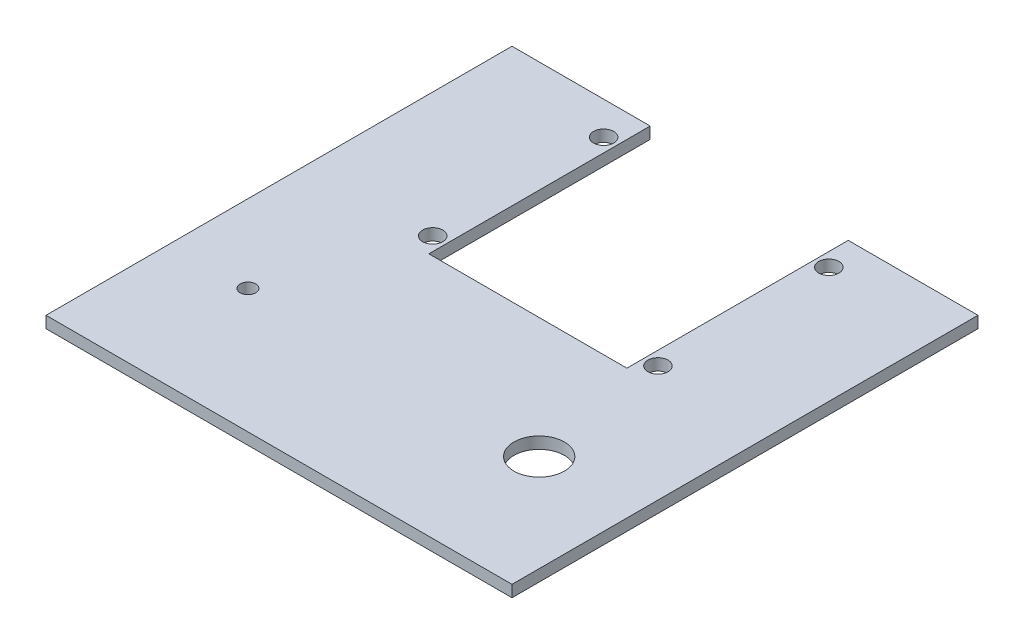
ISO-10303-21;
HEADER;
FILE_DESCRIPTION(('STEP AP214'),'2;1');
FILE_NAME('part.step','',(''),(''),'','','');
FILE_SCHEMA(('AUTOMOTIVE_DESIGN { 1 0 10303 214 1 1 1 1 }'));
ENDSEC;
DATA;
#1=APPLICATION_CONTEXT('core data for automotive mechanical design processes');
#2=APPLICATION_PROTOCOL_DEFINITION('international standard','automotive_design',2000,#1);
#3=PRODUCT_CONTEXT('',#1,'mechanical');
#4=PRODUCT('Part','Part','',(#3));
#5=PRODUCT_RELATED_PRODUCT_CATEGORY('part','',(#4));
#6=PRODUCT_DEFINITION_FORMATION('','',#4);
#7=PRODUCT_DEFINITION_CONTEXT('part definition',#1,'design');
#8=PRODUCT_DEFINITION('design','',#6,#7);
#9=PRODUCT_DEFINITION_SHAPE('','',#8);
#10=(LENGTH_UNIT() NAMED_UNIT(*) SI_UNIT(.MILLI.,.METRE.));
#11=(NAMED_UNIT(*) PLANE_ANGLE_UNIT() SI_UNIT($,.RADIAN.));
#12=(NAMED_UNIT(*) SI_UNIT($,.STERADIAN.) SOLID_ANGLE_UNIT());
#13=UNCERTAINTY_MEASURE_WITH_UNIT(LENGTH_MEASURE(1.E-05),#10,'distance_accuracy_value','');
#14=(GEOMETRIC_REPRESENTATION_CONTEXT(3) GLOBAL_UNCERTAINTY_ASSIGNED_CONTEXT((#13)) GLOBAL_UNIT_ASSIGNED_CONTEXT((#10,
#11,#12)) REPRESENTATION_CONTEXT('',''));
#15=CARTESIAN_POINT('',(0.,0.,0.));
#16=DIRECTION('',(0.,0.,1.));
#17=DIRECTION('',(1.,0.,0.));
#18=AXIS2_PLACEMENT_3D('',#15,#16,#17);
#19=CARTESIAN_POINT('',(0.,3.,0.));
#20=DIRECTION('',(0.,0.,1.));
#21=DIRECTION('',(1.,0.,0.));
#22=AXIS2_PLACEMENT_3D('',#19,#20,#21);
#23=PLANE('',#22);
#24=DIRECTION('',(-1.,0.,0.));
#25=VECTOR('',#24,1.);
#26=CARTESIAN_POINT('',(0.,3.,0.));
#27=LINE('',#26,#25);
#28=CARTESIAN_POINT('',(35.586613668419,3.,0.));
#29=VERTEX_POINT('',#28);
#30=CARTESIAN_POINT('',(0.,3.,0.));
#31=VERTEX_POINT('',#30);
#32=EDGE_CURVE('E60',#29,#31,#27,.T.);
#33=ORIENTED_EDGE('',*,*,#32,.F.);
#34=DIRECTION('',(0.,1.,0.));
#35=VECTOR('',#34,1.);
#36=CARTESIAN_POINT('',(35.586613668419,0.,0.));
#37=LINE('',#36,#35);
#38=CARTESIAN_POINT('',(35.586613668419,0.,0.));
#39=VERTEX_POINT('',#38);
#40=EDGE_CURVE('E141',#39,#29,#37,.T.);
#41=ORIENTED_EDGE('',*,*,#40,.F.);
#42=DIRECTION('',(-1.,0.,0.));
#43=VECTOR('',#42,1.);
#44=CARTESIAN_POINT('',(0.,0.,0.));
#45=LINE('',#44,#43);
#46=CARTESIAN_POINT('',(0.,0.,0.));
#47=VERTEX_POINT('',#46);
#48=EDGE_CURVE('E82',#39,#47,#45,.T.);
#49=ORIENTED_EDGE('',*,*,#48,.T.);
#50=DIRECTION('',(0.,-1.,0.));
#51=VECTOR('',#50,1.);
#52=CARTESIAN_POINT('',(0.,3.,0.));
#53=LINE('',#52,#51);
#54=EDGE_CURVE('E168',#31,#47,#53,.T.);
#55=ORIENTED_EDGE('',*,*,#54,.F.);
#56=EDGE_LOOP('',(#33,#41,#49,#55));
#57=FACE_BOUND('',#56,.T.);
#58=ADVANCED_FACE('F36',(#57),#23,.F.);
#59=CARTESIAN_POINT('',(0.,3.,120.));
#60=DIRECTION('',(1.,0.,0.));
#61=DIRECTION('',(0.,0.,-1.));
#62=AXIS2_PLACEMENT_3D('',#59,#60,#61);
#63=PLANE('',#62);
#64=DIRECTION('',(0.,0.,1.));
#65=VECTOR('',#64,1.);
#66=CARTESIAN_POINT('',(0.,0.,120.));
#67=LINE('',#66,#65);
#68=CARTESIAN_POINT('',(0.,0.,120.));
#69=VERTEX_POINT('',#68);
#70=EDGE_CURVE('E169',#47,#69,#67,.T.);
#71=ORIENTED_EDGE('',*,*,#70,.T.);
#72=DIRECTION('',(0.,-1.,0.));
#73=VECTOR('',#72,1.);
#74=CARTESIAN_POINT('',(0.,3.,120.));
#75=LINE('',#74,#73);
#76=CARTESIAN_POINT('',(0.,3.,120.));
#77=VERTEX_POINT('',#76);
#78=EDGE_CURVE('E11',#77,#69,#75,.T.);
#79=ORIENTED_EDGE('',*,*,#78,.F.);
#80=DIRECTION('',(0.,0.,1.));
#81=VECTOR('',#80,1.);
#82=CARTESIAN_POINT('',(0.,3.,120.));
#83=LINE('',#82,#81);
#84=EDGE_CURVE('E159',#31,#77,#83,.T.);
#85=ORIENTED_EDGE('',*,*,#84,.F.);
#86=ORIENTED_EDGE('',*,*,#54,.T.);
#87=EDGE_LOOP('',(#71,#79,#85,#86));
#88=FACE_BOUND('',#87,.T.);
#89=ADVANCED_FACE('F38',(#88),#63,.F.);
#90=CARTESIAN_POINT('',(120.,3.,120.));
#91=DIRECTION('',(0.,0.,-1.));
#92=DIRECTION('',(-1.,0.,0.));
#93=AXIS2_PLACEMENT_3D('',#90,#91,#92);
#94=PLANE('',#93);
#95=DIRECTION('',(1.,0.,0.));
#96=VECTOR('',#95,1.);
#97=CARTESIAN_POINT('',(120.,0.,120.));
#98=LINE('',#97,#96);
#99=CARTESIAN_POINT('',(120.,0.,120.));
#100=VERTEX_POINT('',#99);
#101=EDGE_CURVE('E172',#69,#100,#98,.T.);
#102=ORIENTED_EDGE('',*,*,#101,.T.);
#103=DIRECTION('',(0.,-1.,0.));
#104=VECTOR('',#103,1.);
#105=CARTESIAN_POINT('',(120.,3.,120.));
#106=LINE('',#105,#104);
#107=CARTESIAN_POINT('',(120.,3.,120.));
#108=VERTEX_POINT('',#107);
#109=EDGE_CURVE('E44',#108,#100,#106,.T.);
#110=ORIENTED_EDGE('',*,*,#109,.F.);
#111=DIRECTION('',(1.,0.,0.));
#112=VECTOR('',#111,1.);
#113=CARTESIAN_POINT('',(120.,3.,120.));
#114=LINE('',#113,#112);
#115=EDGE_CURVE('E89',#77,#108,#114,.T.);
#116=ORIENTED_EDGE('',*,*,#115,.F.);
#117=ORIENTED_EDGE('',*,*,#78,.T.);
#118=EDGE_LOOP('',(#102,#110,#116,#117));
#119=FACE_BOUND('',#118,.T.);
#120=ADVANCED_FACE('F197',(#119),#94,.F.);
#121=CARTESIAN_POINT('',(120.,3.,0.));
#122=DIRECTION('',(-1.,0.,0.));
#123=DIRECTION('',(0.,0.,1.));
#124=AXIS2_PLACEMENT_3D('',#121,#122,#123);
#125=PLANE('',#124);
#126=DIRECTION('',(0.,0.,-1.));
#127=VECTOR('',#126,1.);
#128=CARTESIAN_POINT('',(120.,0.,0.));
#129=LINE('',#128,#127);
#130=CARTESIAN_POINT('',(120.,0.,0.));
#131=VERTEX_POINT('',#130);
#132=EDGE_CURVE('E175',#100,#131,#129,.T.);
#133=ORIENTED_EDGE('',*,*,#132,.T.);
#134=DIRECTION('',(0.,-1.,0.));
#135=VECTOR('',#134,1.);
#136=CARTESIAN_POINT('',(120.,3.,0.));
#137=LINE('',#136,#135);
#138=CARTESIAN_POINT('',(120.,3.,0.));
#139=VERTEX_POINT('',#138);
#140=EDGE_CURVE('E180',#139,#131,#137,.T.);
#141=ORIENTED_EDGE('',*,*,#140,.F.);
#142=DIRECTION('',(0.,0.,-1.));
#143=VECTOR('',#142,1.);
#144=CARTESIAN_POINT('',(120.,3.,0.));
#145=LINE('',#144,#143);
#146=EDGE_CURVE('E163',#108,#139,#145,.T.);
#147=ORIENTED_EDGE('',*,*,#146,.F.);
#148=ORIENTED_EDGE('',*,*,#109,.T.);
#149=EDGE_LOOP('',(#133,#141,#147,#148));
#150=FACE_BOUND('',#149,.T.);
#151=ADVANCED_FACE('F186',(#150),#125,.F.);
#152=CARTESIAN_POINT('',(86.586613668419,0.,0.));
#153=VERTEX_POINT('',#152);
#154=EDGE_CURVE('E161',#131,#153,#45,.T.);
#155=ORIENTED_EDGE('',*,*,#154,.T.);
#156=DIRECTION('',(0.,1.,0.));
#157=VECTOR('',#156,1.);
#158=CARTESIAN_POINT('',(86.586613668419,0.,0.));
#159=LINE('',#158,#157);
#160=CARTESIAN_POINT('',(86.586613668419,3.,0.));
#161=VERTEX_POINT('',#160);
#162=EDGE_CURVE('E143',#153,#161,#159,.T.);
#163=ORIENTED_EDGE('',*,*,#162,.T.);
#164=EDGE_CURVE('E165',#139,#161,#27,.T.);
#165=ORIENTED_EDGE('',*,*,#164,.F.);
#166=ORIENTED_EDGE('',*,*,#140,.T.);
#167=EDGE_LOOP('',(#155,#163,#165,#166));
#168=FACE_BOUND('',#167,.T.);
#169=ADVANCED_FACE('F190',(#168),#23,.F.);
#170=CARTESIAN_POINT('',(0.,3.,0.));
#171=DIRECTION('',(0.,-1.,0.));
#172=DIRECTION('',(0.,0.,-1.));
#173=AXIS2_PLACEMENT_3D('',#170,#171,#172);
#174=PLANE('',#173);
#175=CARTESIAN_POINT('',(20.,3.,88.));
#176=DIRECTION('',(0.,1.,0.));
#177=DIRECTION('',(0.,0.,1.));
#178=AXIS2_PLACEMENT_3D('',#175,#176,#177);
#179=CIRCLE('',#178,2.00000000000001);
#180=CARTESIAN_POINT('',(20.,3.,90.));
#181=VERTEX_POINT('',#180);
#182=EDGE_CURVE('E259',#181,#181,#179,.T.);
#183=ORIENTED_EDGE('',*,*,#182,.F.);
#184=EDGE_LOOP('',(#183));
#185=FACE_BOUND('',#184,.T.);
#186=CARTESIAN_POINT('',(90.086613668419,3.,52.5));
#187=DIRECTION('',(0.,1.,0.));
#188=DIRECTION('',(0.,0.,1.));
#189=AXIS2_PLACEMENT_3D('',#186,#187,#188);
#190=CIRCLE('',#189,2.6);
#191=CARTESIAN_POINT('',(90.086613668419,3.,55.1));
#192=VERTEX_POINT('',#191);
#193=EDGE_CURVE('E273',#192,#192,#190,.T.);
#194=ORIENTED_EDGE('',*,*,#193,.F.);
#195=EDGE_LOOP('',(#194));
#196=FACE_BOUND('',#195,.T.);
#197=CARTESIAN_POINT('',(90.086613668419,3.,8.5));
#198=DIRECTION('',(0.,1.,0.));
#199=DIRECTION('',(0.,0.,1.));
#200=AXIS2_PLACEMENT_3D('',#197,#198,#199);
#201=CIRCLE('',#200,2.6);
#202=CARTESIAN_POINT('',(90.086613668419,3.,11.1));
#203=VERTEX_POINT('',#202);
#204=EDGE_CURVE('E267',#203,#203,#201,.T.);
#205=ORIENTED_EDGE('',*,*,#204,.F.);
#206=EDGE_LOOP('',(#205));
#207=FACE_BOUND('',#206,.T.);
#208=CARTESIAN_POINT('',(32.0866136684191,3.,52.5));
#209=DIRECTION('',(0.,1.,0.));
#210=DIRECTION('',(0.,0.,1.));
#211=AXIS2_PLACEMENT_3D('',#208,#209,#210);
#212=CIRCLE('',#211,2.6);
#213=CARTESIAN_POINT('',(32.0866136684191,3.,55.1));
#214=VERTEX_POINT('',#213);
#215=EDGE_CURVE('E155',#214,#214,#212,.T.);
#216=ORIENTED_EDGE('',*,*,#215,.F.);
#217=EDGE_LOOP('',(#216));
#218=FACE_BOUND('',#217,.T.);
#219=CARTESIAN_POINT('',(32.086613668419,3.,8.5));
#220=DIRECTION('',(0.,1.,0.));
#221=DIRECTION('',(0.,0.,1.));
#222=AXIS2_PLACEMENT_3D('',#219,#220,#221);
#223=CIRCLE('',#222,2.6);
#224=CARTESIAN_POINT('',(32.086613668419,3.,11.1));
#225=VERTEX_POINT('',#224);
#226=EDGE_CURVE('E149',#225,#225,#223,.T.);
#227=ORIENTED_EDGE('',*,*,#226,.F.);
#228=EDGE_LOOP('',(#227));
#229=FACE_BOUND('',#228,.T.);
#230=CARTESIAN_POINT('',(95.,3.,88.));
#231=DIRECTION('',(0.,1.,0.));
#232=DIRECTION('',(0.,0.,1.));
#233=AXIS2_PLACEMENT_3D('',#230,#231,#232);
#234=CIRCLE('',#233,6.5);
#235=CARTESIAN_POINT('',(95.,3.,94.5));
#236=VERTEX_POINT('',#235);
#237=EDGE_CURVE('E134',#236,#236,#234,.T.);
#238=ORIENTED_EDGE('',*,*,#237,.F.);
#239=EDGE_LOOP('',(#238));
#240=FACE_BOUND('',#239,.T.);
#241=DIRECTION('',(1.,0.,0.));
#242=VECTOR('',#241,1.);
#243=CARTESIAN_POINT('',(86.586613668419,3.,57.));
#244=LINE('',#243,#242);
#245=CARTESIAN_POINT('',(35.5866136684191,3.,57.));
#246=VERTEX_POINT('',#245);
#247=CARTESIAN_POINT('',(86.586613668419,3.,57.));
#248=VERTEX_POINT('',#247);
#249=EDGE_CURVE('E131',#246,#248,#244,.T.);
#250=ORIENTED_EDGE('',*,*,#249,.F.);
#251=DIRECTION('',(0.,0.,1.));
#252=VECTOR('',#251,1.);
#253=CARTESIAN_POINT('',(35.5866136684191,3.,57.));
#254=LINE('',#253,#252);
#255=EDGE_CURVE('E115',#29,#246,#254,.T.);
#256=ORIENTED_EDGE('',*,*,#255,.F.);
#257=ORIENTED_EDGE('',*,*,#32,.T.);
#258=ORIENTED_EDGE('',*,*,#84,.T.);
#259=ORIENTED_EDGE('',*,*,#115,.T.);
#260=ORIENTED_EDGE('',*,*,#146,.T.);
#261=ORIENTED_EDGE('',*,*,#164,.T.);
#262=DIRECTION('',(0.,0.,-1.));
#263=VECTOR('',#262,1.);
#264=CARTESIAN_POINT('',(86.586613668419,3.,0.));
#265=LINE('',#264,#263);
#266=EDGE_CURVE('E129',#248,#161,#265,.T.);
#267=ORIENTED_EDGE('',*,*,#266,.F.);
#268=EDGE_LOOP('',(#250,#256,#257,#258,#259,#260,#261,#267));
#269=FACE_BOUND('',#268,.T.);
#270=ADVANCED_FACE('F193',(#185,#196,#207,#218,#229,#240,#269),#174,.F.);
#271=CARTESIAN_POINT('',(0.,0.,0.));
#272=DIRECTION('',(0.,-1.,0.));
#273=DIRECTION('',(0.,0.,-1.));
#274=AXIS2_PLACEMENT_3D('',#271,#272,#273);
#275=PLANE('',#274);
#276=CARTESIAN_POINT('',(20.,0.,88.));
#277=DIRECTION('',(0.,1.,0.));
#278=DIRECTION('',(0.,0.,1.));
#279=AXIS2_PLACEMENT_3D('',#276,#277,#278);
#280=CIRCLE('',#279,2.00000000000001);
#281=CARTESIAN_POINT('',(20.,0.,90.));
#282=VERTEX_POINT('',#281);
#283=EDGE_CURVE('E173',#282,#282,#280,.T.);
#284=ORIENTED_EDGE('',*,*,#283,.T.);
#285=EDGE_LOOP('',(#284));
#286=FACE_BOUND('',#285,.T.);
#287=CARTESIAN_POINT('',(90.086613668419,0.,52.5));
#288=DIRECTION('',(0.,1.,0.));
#289=DIRECTION('',(0.,0.,1.));
#290=AXIS2_PLACEMENT_3D('',#287,#288,#289);
#291=CIRCLE('',#290,2.6);
#292=CARTESIAN_POINT('',(90.086613668419,0.,55.1));
#293=VERTEX_POINT('',#292);
#294=EDGE_CURVE('E270',#293,#293,#291,.T.);
#295=ORIENTED_EDGE('',*,*,#294,.T.);
#296=EDGE_LOOP('',(#295));
#297=FACE_BOUND('',#296,.T.);
#298=CARTESIAN_POINT('',(90.086613668419,0.,8.5));
#299=DIRECTION('',(0.,1.,0.));
#300=DIRECTION('',(0.,0.,1.));
#301=AXIS2_PLACEMENT_3D('',#298,#299,#300);
#302=CIRCLE('',#301,2.6);
#303=CARTESIAN_POINT('',(90.086613668419,0.,11.1));
#304=VERTEX_POINT('',#303);
#305=EDGE_CURVE('E158',#304,#304,#302,.T.);
#306=ORIENTED_EDGE('',*,*,#305,.T.);
#307=EDGE_LOOP('',(#306));
#308=FACE_BOUND('',#307,.T.);
#309=CARTESIAN_POINT('',(32.0866136684191,0.,52.5));
#310=DIRECTION('',(0.,1.,0.));
#311=DIRECTION('',(0.,0.,1.));
#312=AXIS2_PLACEMENT_3D('',#309,#310,#311);
#313=CIRCLE('',#312,2.6);
#314=CARTESIAN_POINT('',(32.0866136684191,0.,55.1));
#315=VERTEX_POINT('',#314);
#316=EDGE_CURVE('E152',#315,#315,#313,.T.);
#317=ORIENTED_EDGE('',*,*,#316,.T.);
#318=EDGE_LOOP('',(#317));
#319=FACE_BOUND('',#318,.T.);
#320=CARTESIAN_POINT('',(32.086613668419,0.,8.5));
#321=DIRECTION('',(0.,1.,0.));
#322=DIRECTION('',(0.,0.,1.));
#323=AXIS2_PLACEMENT_3D('',#320,#321,#322);
#324=CIRCLE('',#323,2.6);
#325=CARTESIAN_POINT('',(32.086613668419,0.,11.1));
#326=VERTEX_POINT('',#325);
#327=EDGE_CURVE('E139',#326,#326,#324,.T.);
#328=ORIENTED_EDGE('',*,*,#327,.T.);
#329=EDGE_LOOP('',(#328));
#330=FACE_BOUND('',#329,.T.);
#331=DIRECTION('',(0.,0.,1.));
#332=VECTOR('',#331,1.);
#333=CARTESIAN_POINT('',(35.5866136684191,0.,57.));
#334=LINE('',#333,#332);
#335=CARTESIAN_POINT('',(35.5866136684191,0.,57.));
#336=VERTEX_POINT('',#335);
#337=EDGE_CURVE('E114',#39,#336,#334,.T.);
#338=ORIENTED_EDGE('',*,*,#337,.T.);
#339=DIRECTION('',(1.,0.,0.));
#340=VECTOR('',#339,1.);
#341=CARTESIAN_POINT('',(86.586613668419,0.,57.));
#342=LINE('',#341,#340);
#343=CARTESIAN_POINT('',(86.586613668419,0.,57.));
#344=VERTEX_POINT('',#343);
#345=EDGE_CURVE('E122',#336,#344,#342,.T.);
#346=ORIENTED_EDGE('',*,*,#345,.T.);
#347=DIRECTION('',(0.,0.,-1.));
#348=VECTOR('',#347,1.);
#349=CARTESIAN_POINT('',(86.586613668419,0.,0.));
#350=LINE('',#349,#348);
#351=EDGE_CURVE('E51',#344,#153,#350,.T.);
#352=ORIENTED_EDGE('',*,*,#351,.T.);
#353=ORIENTED_EDGE('',*,*,#154,.F.);
#354=ORIENTED_EDGE('',*,*,#132,.F.);
#355=ORIENTED_EDGE('',*,*,#101,.F.);
#356=ORIENTED_EDGE('',*,*,#70,.F.);
#357=ORIENTED_EDGE('',*,*,#48,.F.);
#358=EDGE_LOOP('',(#338,#346,#352,#353,#354,#355,#356,#357));
#359=FACE_BOUND('',#358,.T.);
#360=CARTESIAN_POINT('',(95.,0.,88.));
#361=DIRECTION('',(0.,1.,0.));
#362=DIRECTION('',(0.,0.,1.));
#363=AXIS2_PLACEMENT_3D('',#360,#361,#362);
#364=CIRCLE('',#363,6.5);
#365=CARTESIAN_POINT('',(95.,0.,94.5));
#366=VERTEX_POINT('',#365);
#367=EDGE_CURVE('E260',#366,#366,#364,.T.);
#368=ORIENTED_EDGE('',*,*,#367,.T.);
#369=EDGE_LOOP('',(#368));
#370=FACE_BOUND('',#369,.T.);
#371=ADVANCED_FACE('F126',(#286,#297,#308,#319,#330,#359,#370),#275,.T.);
#372=CARTESIAN_POINT('',(95.,0.,88.));
#373=DIRECTION('',(0.,1.,0.));
#374=DIRECTION('',(0.,0.,1.));
#375=AXIS2_PLACEMENT_3D('',#372,#373,#374);
#376=CYLINDRICAL_SURFACE('',#375,6.5);
#377=ORIENTED_EDGE('',*,*,#367,.F.);
#378=EDGE_LOOP('',(#377));
#379=FACE_BOUND('',#378,.T.);
#380=ORIENTED_EDGE('',*,*,#237,.T.);
#381=EDGE_LOOP('',(#380));
#382=FACE_BOUND('',#381,.T.);
#383=ADVANCED_FACE('F219',(#379,#382),#376,.F.);
#384=CARTESIAN_POINT('',(35.5866136684191,0.,57.));
#385=DIRECTION('',(-1.,0.,0.));
#386=DIRECTION('',(0.,0.,1.));
#387=AXIS2_PLACEMENT_3D('',#384,#385,#386);
#388=PLANE('',#387);
#389=ORIENTED_EDGE('',*,*,#255,.T.);
#390=DIRECTION('',(0.,1.,0.));
#391=VECTOR('',#390,1.);
#392=CARTESIAN_POINT('',(35.5866136684191,0.,57.));
#393=LINE('',#392,#391);
#394=EDGE_CURVE('E110',#336,#246,#393,.T.);
#395=ORIENTED_EDGE('',*,*,#394,.F.);
#396=ORIENTED_EDGE('',*,*,#337,.F.);
#397=ORIENTED_EDGE('',*,*,#40,.T.);
#398=EDGE_LOOP('',(#389,#395,#396,#397));
#399=FACE_BOUND('',#398,.T.);
#400=ADVANCED_FACE('F112',(#399),#388,.F.);
#401=CARTESIAN_POINT('',(86.586613668419,0.,0.));
#402=DIRECTION('',(1.,0.,0.));
#403=DIRECTION('',(0.,0.,-1.));
#404=AXIS2_PLACEMENT_3D('',#401,#402,#403);
#405=PLANE('',#404);
#406=ORIENTED_EDGE('',*,*,#266,.T.);
#407=ORIENTED_EDGE('',*,*,#162,.F.);
#408=ORIENTED_EDGE('',*,*,#351,.F.);
#409=DIRECTION('',(0.,1.,0.));
#410=VECTOR('',#409,1.);
#411=CARTESIAN_POINT('',(86.586613668419,0.,57.));
#412=LINE('',#411,#410);
#413=EDGE_CURVE('E119',#344,#248,#412,.T.);
#414=ORIENTED_EDGE('',*,*,#413,.T.);
#415=EDGE_LOOP('',(#406,#407,#408,#414));
#416=FACE_BOUND('',#415,.T.);
#417=ADVANCED_FACE('F235',(#416),#405,.F.);
#418=CARTESIAN_POINT('',(86.586613668419,0.,57.));
#419=DIRECTION('',(0.,0.,1.));
#420=DIRECTION('',(1.,0.,0.));
#421=AXIS2_PLACEMENT_3D('',#418,#419,#420);
#422=PLANE('',#421);
#423=ORIENTED_EDGE('',*,*,#249,.T.);
#424=ORIENTED_EDGE('',*,*,#413,.F.);
#425=ORIENTED_EDGE('',*,*,#345,.F.);
#426=ORIENTED_EDGE('',*,*,#394,.T.);
#427=EDGE_LOOP('',(#423,#424,#425,#426));
#428=FACE_BOUND('',#427,.T.);
#429=ADVANCED_FACE('F123',(#428),#422,.F.);
#430=CARTESIAN_POINT('',(32.086613668419,0.,8.5));
#431=DIRECTION('',(0.,1.,0.));
#432=DIRECTION('',(0.,0.,1.));
#433=AXIS2_PLACEMENT_3D('',#430,#431,#432);
#434=CYLINDRICAL_SURFACE('',#433,2.6);
#435=ORIENTED_EDGE('',*,*,#327,.F.);
#436=EDGE_LOOP('',(#435));
#437=FACE_BOUND('',#436,.T.);
#438=ORIENTED_EDGE('',*,*,#226,.T.);
#439=EDGE_LOOP('',(#438));
#440=FACE_BOUND('',#439,.T.);
#441=ADVANCED_FACE('F228',(#437,#440),#434,.F.);
#442=CARTESIAN_POINT('',(32.0866136684191,0.,52.5));
#443=DIRECTION('',(0.,1.,0.));
#444=DIRECTION('',(0.,0.,1.));
#445=AXIS2_PLACEMENT_3D('',#442,#443,#444);
#446=CYLINDRICAL_SURFACE('',#445,2.6);
#447=ORIENTED_EDGE('',*,*,#316,.F.);
#448=EDGE_LOOP('',(#447));
#449=FACE_BOUND('',#448,.T.);
#450=ORIENTED_EDGE('',*,*,#215,.T.);
#451=EDGE_LOOP('',(#450));
#452=FACE_BOUND('',#451,.T.);
#453=ADVANCED_FACE('F224',(#449,#452),#446,.F.);
#454=CARTESIAN_POINT('',(90.086613668419,0.,8.5));
#455=DIRECTION('',(0.,1.,0.));
#456=DIRECTION('',(0.,0.,1.));
#457=AXIS2_PLACEMENT_3D('',#454,#455,#456);
#458=CYLINDRICAL_SURFACE('',#457,2.6);
#459=ORIENTED_EDGE('',*,*,#305,.F.);
#460=EDGE_LOOP('',(#459));
#461=FACE_BOUND('',#460,.T.);
#462=ORIENTED_EDGE('',*,*,#204,.T.);
#463=EDGE_LOOP('',(#462));
#464=FACE_BOUND('',#463,.T.);
#465=ADVANCED_FACE('F227',(#461,#464),#458,.F.);
#466=CARTESIAN_POINT('',(90.086613668419,0.,52.5));
#467=DIRECTION('',(0.,1.,0.));
#468=DIRECTION('',(0.,0.,1.));
#469=AXIS2_PLACEMENT_3D('',#466,#467,#468);
#470=CYLINDRICAL_SURFACE('',#469,2.6);
#471=ORIENTED_EDGE('',*,*,#294,.F.);
#472=EDGE_LOOP('',(#471));
#473=FACE_BOUND('',#472,.T.);
#474=ORIENTED_EDGE('',*,*,#193,.T.);
#475=EDGE_LOOP('',(#474));
#476=FACE_BOUND('',#475,.T.);
#477=ADVANCED_FACE('F243',(#473,#476),#470,.F.);
#478=CARTESIAN_POINT('',(20.,0.,88.));
#479=DIRECTION('',(0.,1.,0.));
#480=DIRECTION('',(0.,0.,1.));
#481=AXIS2_PLACEMENT_3D('',#478,#479,#480);
#482=CYLINDRICAL_SURFACE('',#481,2.00000000000001);
#483=ORIENTED_EDGE('',*,*,#283,.F.);
#484=EDGE_LOOP('',(#483));
#485=FACE_BOUND('',#484,.T.);
#486=ORIENTED_EDGE('',*,*,#182,.T.);
#487=EDGE_LOOP('',(#486));
#488=FACE_BOUND('',#487,.T.);
#489=ADVANCED_FACE('F246',(#485,#488),#482,.F.);
#490=CLOSED_SHELL('',(#58,#89,#120,#151,#169,#270,#371,#383,#400,#417,#429,#441,#453,#465,#477,#489));
#491=MANIFOLD_SOLID_BREP('B2',#490);
#492=ADVANCED_BREP_SHAPE_REPRESENTATION('',(#18,#491),#14);
#493=SHAPE_DEFINITION_REPRESENTATION(#9,#492);
ENDSEC;
END-ISO-10303-21;
